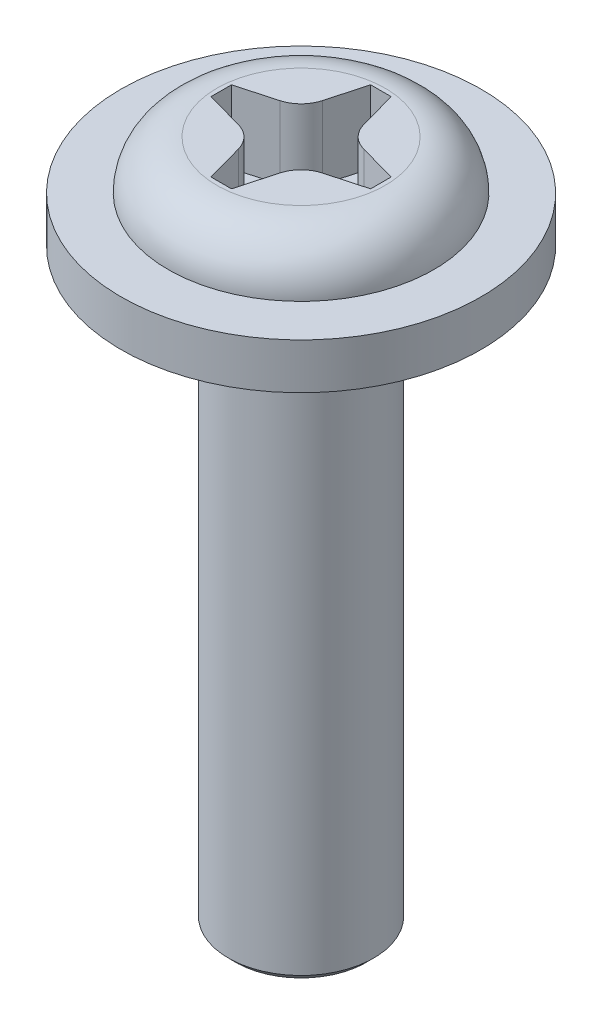
ISO-10303-21;
HEADER;
FILE_DESCRIPTION(('STEP AP214'),'2;1');
FILE_NAME('part.step','',(''),(''),'','','');
FILE_SCHEMA(('AUTOMOTIVE_DESIGN { 1 0 10303 214 1 1 1 1 }'));
ENDSEC;
DATA;
#1=APPLICATION_CONTEXT('core data for automotive mechanical design processes');
#2=APPLICATION_PROTOCOL_DEFINITION('international standard','automotive_design',2000,#1);
#3=PRODUCT_CONTEXT('',#1,'mechanical');
#4=PRODUCT('Part','Part','',(#3));
#5=PRODUCT_RELATED_PRODUCT_CATEGORY('part','',(#4));
#6=PRODUCT_DEFINITION_FORMATION('','',#4);
#7=PRODUCT_DEFINITION_CONTEXT('part definition',#1,'design');
#8=PRODUCT_DEFINITION('design','',#6,#7);
#9=PRODUCT_DEFINITION_SHAPE('','',#8);
#10=(LENGTH_UNIT() NAMED_UNIT(*) SI_UNIT(.MILLI.,.METRE.));
#11=(NAMED_UNIT(*) PLANE_ANGLE_UNIT() SI_UNIT($,.RADIAN.));
#12=(NAMED_UNIT(*) SI_UNIT($,.STERADIAN.) SOLID_ANGLE_UNIT());
#13=UNCERTAINTY_MEASURE_WITH_UNIT(LENGTH_MEASURE(1.E-05),#10,'distance_accuracy_value','');
#14=(GEOMETRIC_REPRESENTATION_CONTEXT(3) GLOBAL_UNCERTAINTY_ASSIGNED_CONTEXT((#13)) GLOBAL_UNIT_ASSIGNED_CONTEXT((#10,
#11,#12)) REPRESENTATION_CONTEXT('',''));
#15=CARTESIAN_POINT('',(0.,0.,0.));
#16=DIRECTION('',(0.,0.,1.));
#17=DIRECTION('',(1.,0.,0.));
#18=AXIS2_PLACEMENT_3D('',#15,#16,#17);
#19=CARTESIAN_POINT('',(0.,-9.4,0.));
#20=DIRECTION('',(0.,1.,0.));
#21=DIRECTION('',(-1.,0.,0.));
#22=AXIS2_PLACEMENT_3D('',#19,#20,#21);
#23=PLANE('',#22);
#24=CARTESIAN_POINT('',(0.,-9.4,0.));
#25=DIRECTION('',(0.,1.,0.));
#26=DIRECTION('',(-1.,0.,0.));
#27=AXIS2_PLACEMENT_3D('',#24,#25,#26);
#28=CIRCLE('',#27,0.9);
#29=CARTESIAN_POINT('',(-0.899999999999999,-9.4,0.));
#30=VERTEX_POINT('',#29);
#31=EDGE_CURVE('E11',#30,#30,#28,.T.);
#32=ORIENTED_EDGE('',*,*,#31,.F.);
#33=EDGE_LOOP('',(#32));
#34=FACE_BOUND('',#33,.T.);
#35=ADVANCED_FACE('F35',(#34),#23,.F.);
#36=CARTESIAN_POINT('',(0.,-9.4,0.));
#37=DIRECTION('',(0.,1.,0.));
#38=DIRECTION('',(-1.,0.,0.));
#39=AXIS2_PLACEMENT_3D('',#36,#37,#38);
#40=CONICAL_SURFACE('',#39,0.9,0.785398163397453);
#41=CARTESIAN_POINT('',(0.,-9.3,0.));
#42=DIRECTION('',(0.,1.,0.));
#43=DIRECTION('',(-1.,0.,0.));
#44=AXIS2_PLACEMENT_3D('',#41,#42,#43);
#45=CIRCLE('',#44,1.);
#46=CARTESIAN_POINT('',(-0.999999999999999,-9.3,0.));
#47=VERTEX_POINT('',#46);
#48=EDGE_CURVE('E42',#47,#47,#45,.T.);
#49=ORIENTED_EDGE('',*,*,#48,.F.);
#50=EDGE_LOOP('',(#49));
#51=FACE_BOUND('',#50,.T.);
#52=ORIENTED_EDGE('',*,*,#31,.T.);
#53=EDGE_LOOP('',(#52));
#54=FACE_BOUND('',#53,.T.);
#55=ADVANCED_FACE('F269',(#51,#54),#40,.T.);
#56=CARTESIAN_POINT('',(0.,0.,0.));
#57=DIRECTION('',(0.,1.,0.));
#58=DIRECTION('',(-1.,0.,0.));
#59=AXIS2_PLACEMENT_3D('',#56,#57,#58);
#60=CYLINDRICAL_SURFACE('',#59,1.);
#61=CARTESIAN_POINT('',(0.,-1.3,0.));
#62=DIRECTION('',(0.,1.,0.));
#63=DIRECTION('',(-1.,0.,0.));
#64=AXIS2_PLACEMENT_3D('',#61,#62,#63);
#65=CIRCLE('',#64,1.);
#66=CARTESIAN_POINT('',(-1.,-1.3,0.));
#67=VERTEX_POINT('',#66);
#68=EDGE_CURVE('E262',#67,#67,#65,.T.);
#69=ORIENTED_EDGE('',*,*,#68,.F.);
#70=EDGE_LOOP('',(#69));
#71=FACE_BOUND('',#70,.T.);
#72=ORIENTED_EDGE('',*,*,#48,.T.);
#73=EDGE_LOOP('',(#72));
#74=FACE_BOUND('',#73,.T.);
#75=ADVANCED_FACE('F267',(#71,#74),#60,.T.);
#76=CARTESIAN_POINT('',(1.,-1.3,0.));
#77=DIRECTION('',(0.,1.,0.));
#78=DIRECTION('',(-1.,0.,0.));
#79=AXIS2_PLACEMENT_3D('',#76,#77,#78);
#80=PLANE('',#79);
#81=CARTESIAN_POINT('',(0.,-1.3,0.));
#82=DIRECTION('',(0.,1.,0.));
#83=DIRECTION('',(-1.,0.,0.));
#84=AXIS2_PLACEMENT_3D('',#81,#82,#83);
#85=CIRCLE('',#84,2.48);
#86=CARTESIAN_POINT('',(-2.48,-1.3,0.));
#87=VERTEX_POINT('',#86);
#88=EDGE_CURVE('E259',#87,#87,#85,.T.);
#89=ORIENTED_EDGE('',*,*,#88,.F.);
#90=EDGE_LOOP('',(#89));
#91=FACE_BOUND('',#90,.T.);
#92=ORIENTED_EDGE('',*,*,#68,.T.);
#93=EDGE_LOOP('',(#92));
#94=FACE_BOUND('',#93,.T.);
#95=ADVANCED_FACE('F288',(#91,#94),#80,.F.);
#96=CARTESIAN_POINT('',(0.,0.,0.));
#97=DIRECTION('',(0.,1.,0.));
#98=DIRECTION('',(-1.,0.,0.));
#99=AXIS2_PLACEMENT_3D('',#96,#97,#98);
#100=CYLINDRICAL_SURFACE('',#99,2.48);
#101=CARTESIAN_POINT('',(0.,-0.67,0.));
#102=DIRECTION('',(0.,1.,0.));
#103=DIRECTION('',(-1.,0.,0.));
#104=AXIS2_PLACEMENT_3D('',#101,#102,#103);
#105=CIRCLE('',#104,2.48);
#106=CARTESIAN_POINT('',(-2.48,-0.670000000000001,0.));
#107=VERTEX_POINT('',#106);
#108=EDGE_CURVE('E256',#107,#107,#105,.T.);
#109=ORIENTED_EDGE('',*,*,#108,.F.);
#110=EDGE_LOOP('',(#109));
#111=FACE_BOUND('',#110,.T.);
#112=ORIENTED_EDGE('',*,*,#88,.T.);
#113=EDGE_LOOP('',(#112));
#114=FACE_BOUND('',#113,.T.);
#115=ADVANCED_FACE('F295',(#111,#114),#100,.T.);
#116=CARTESIAN_POINT('',(2.48,-0.67,0.));
#117=DIRECTION('',(0.,-1.,0.));
#118=DIRECTION('',(1.,0.,0.));
#119=AXIS2_PLACEMENT_3D('',#116,#117,#118);
#120=PLANE('',#119);
#121=CARTESIAN_POINT('',(0.,-0.67,0.));
#122=DIRECTION('',(0.,1.,0.));
#123=DIRECTION('',(-1.,0.,0.));
#124=AXIS2_PLACEMENT_3D('',#121,#122,#123);
#125=CIRCLE('',#124,1.83);
#126=CARTESIAN_POINT('',(-1.83,-0.67,0.));
#127=VERTEX_POINT('',#126);
#128=EDGE_CURVE('E253',#127,#127,#125,.T.);
#129=ORIENTED_EDGE('',*,*,#128,.F.);
#130=EDGE_LOOP('',(#129));
#131=FACE_BOUND('',#130,.T.);
#132=ORIENTED_EDGE('',*,*,#108,.T.);
#133=EDGE_LOOP('',(#132));
#134=FACE_BOUND('',#133,.T.);
#135=ADVANCED_FACE('F303',(#131,#134),#120,.F.);
#136=CARTESIAN_POINT('',(0.,-0.67,0.));
#137=DIRECTION('',(0.,1.,0.));
#138=DIRECTION('',(-1.,0.,0.));
#139=AXIS2_PLACEMENT_3D('',#136,#137,#138);
#140=TOROIDAL_SURFACE('',#139,1.16,0.67);
#141=CARTESIAN_POINT('',(0.,0.,0.));
#142=DIRECTION('',(0.,1.,0.));
#143=DIRECTION('',(-1.,0.,0.));
#144=AXIS2_PLACEMENT_3D('',#141,#142,#143);
#145=CIRCLE('',#144,1.16);
#146=CARTESIAN_POINT('',(-1.16,0.,0.));
#147=VERTEX_POINT('',#146);
#148=EDGE_CURVE('E225',#147,#147,#145,.T.);
#149=ORIENTED_EDGE('',*,*,#148,.F.);
#150=EDGE_LOOP('',(#149));
#151=FACE_BOUND('',#150,.T.);
#152=ORIENTED_EDGE('',*,*,#128,.T.);
#153=EDGE_LOOP('',(#152));
#154=FACE_BOUND('',#153,.T.);
#155=ADVANCED_FACE('F311',(#151,#154),#140,.T.);
#156=CARTESIAN_POINT('',(1.16,0.,0.));
#157=DIRECTION('',(0.,-1.,0.));
#158=DIRECTION('',(1.,0.,0.));
#159=AXIS2_PLACEMENT_3D('',#156,#157,#158);
#160=PLANE('',#159);
#161=DIRECTION('',(-0.266310401092353,0.,0.963887322393043));
#162=VECTOR('',#161,1.);
#163=CARTESIAN_POINT('',(-0.14140689687852,0.,-1.1));
#164=LINE('',#163,#162);
#165=CARTESIAN_POINT('',(-0.14140689687852,0.,-1.1));
#166=VERTEX_POINT('',#165);
#167=CARTESIAN_POINT('',(-0.285471458842035,0.,-0.578570854487268));
#168=VERTEX_POINT('',#167);
#169=EDGE_CURVE('E182',#166,#168,#164,.T.);
#170=ORIENTED_EDGE('',*,*,#169,.F.);
#171=DIRECTION('',(-1.,0.,0.));
#172=VECTOR('',#171,1.);
#173=CARTESIAN_POINT('',(0.,0.,-1.1));
#174=LINE('',#173,#172);
#175=CARTESIAN_POINT('',(0.141406896878543,0.,-1.1));
#176=VERTEX_POINT('',#175);
#177=EDGE_CURVE('E222',#176,#166,#174,.T.);
#178=ORIENTED_EDGE('',*,*,#177,.F.);
#179=DIRECTION('',(-0.266310401092333,0.,-0.963887322393049));
#180=VECTOR('',#179,1.);
#181=CARTESIAN_POINT('',(0.141406896878543,0.,-1.1));
#182=LINE('',#181,#180);
#183=CARTESIAN_POINT('',(0.285471458842047,0.,-0.578570854487262));
#184=VERTEX_POINT('',#183);
#185=EDGE_CURVE('E220',#184,#176,#182,.T.);
#186=ORIENTED_EDGE('',*,*,#185,.F.);
#187=CARTESIAN_POINT('',(0.690465923304419,0.,-0.690465923304412));
#188=DIRECTION('',(0.,-1.,0.));
#189=DIRECTION('',(-1.,0.,0.));
#190=AXIS2_PLACEMENT_3D('',#187,#188,#189);
#191=CIRCLE('',#190,0.420167850591592);
#192=CARTESIAN_POINT('',(0.578570854487265,0.,-0.285471458842041));
#193=VERTEX_POINT('',#192);
#194=EDGE_CURVE('E218',#193,#184,#191,.T.);
#195=ORIENTED_EDGE('',*,*,#194,.F.);
#196=DIRECTION('',(-0.963887322393046,0.,-0.266310401092343));
#197=VECTOR('',#196,1.);
#198=CARTESIAN_POINT('',(1.1,0.,-0.141406896878531));
#199=LINE('',#198,#197);
#200=CARTESIAN_POINT('',(1.1,0.,-0.141406896878531));
#201=VERTEX_POINT('',#200);
#202=EDGE_CURVE('E156',#201,#193,#199,.T.);
#203=ORIENTED_EDGE('',*,*,#202,.F.);
#204=DIRECTION('',(0.,0.,-1.));
#205=VECTOR('',#204,1.);
#206=CARTESIAN_POINT('',(1.1,0.,0.));
#207=LINE('',#206,#205);
#208=CARTESIAN_POINT('',(1.1,0.,0.141406896878547));
#209=VERTEX_POINT('',#208);
#210=EDGE_CURVE('E214',#209,#201,#207,.T.);
#211=ORIENTED_EDGE('',*,*,#210,.F.);
#212=DIRECTION('',(0.963887322393049,0.,-0.26631040109233));
#213=VECTOR('',#212,1.);
#214=CARTESIAN_POINT('',(1.1,0.,0.141406896878547));
#215=LINE('',#214,#213);
#216=CARTESIAN_POINT('',(0.578570854487261,0.,0.285471458842049));
#217=VERTEX_POINT('',#216);
#218=EDGE_CURVE('E211',#217,#209,#215,.T.);
#219=ORIENTED_EDGE('',*,*,#218,.F.);
#220=CARTESIAN_POINT('',(0.69046592330441,0.,0.690465923304422));
#221=DIRECTION('',(0.,-1.,0.));
#222=DIRECTION('',(-1.,0.,0.));
#223=AXIS2_PLACEMENT_3D('',#220,#221,#222);
#224=CIRCLE('',#223,0.420167850591592);
#225=CARTESIAN_POINT('',(0.285471458842039,0.,0.578570854487266));
#226=VERTEX_POINT('',#225);
#227=EDGE_CURVE('E208',#226,#217,#224,.T.);
#228=ORIENTED_EDGE('',*,*,#227,.F.);
#229=DIRECTION('',(0.266310401092347,0.,-0.963887322393045));
#230=VECTOR('',#229,1.);
#231=CARTESIAN_POINT('',(0.141406896878527,0.,1.1));
#232=LINE('',#231,#230);
#233=CARTESIAN_POINT('',(0.141406896878527,0.,1.1));
#234=VERTEX_POINT('',#233);
#235=EDGE_CURVE('E205',#234,#226,#232,.T.);
#236=ORIENTED_EDGE('',*,*,#235,.F.);
#237=DIRECTION('',(1.,0.,0.));
#238=VECTOR('',#237,1.);
#239=CARTESIAN_POINT('',(0.,0.,1.10000000000001));
#240=LINE('',#239,#238);
#241=CARTESIAN_POINT('',(-0.14140689687855,0.,1.1));
#242=VERTEX_POINT('',#241);
#243=EDGE_CURVE('E202',#242,#234,#240,.T.);
#244=ORIENTED_EDGE('',*,*,#243,.F.);
#245=DIRECTION('',(0.266310401092327,0.,0.96388732239305));
#246=VECTOR('',#245,1.);
#247=CARTESIAN_POINT('',(-0.14140689687855,0.,1.1));
#248=LINE('',#247,#246);
#249=CARTESIAN_POINT('',(-0.285471458842051,0.,0.57857085448726));
#250=VERTEX_POINT('',#249);
#251=EDGE_CURVE('E199',#250,#242,#248,.T.);
#252=ORIENTED_EDGE('',*,*,#251,.F.);
#253=CARTESIAN_POINT('',(-0.690465923304424,0.,0.690465923304407));
#254=DIRECTION('',(0.,-1.,0.));
#255=DIRECTION('',(-1.,0.,0.));
#256=AXIS2_PLACEMENT_3D('',#253,#254,#255);
#257=CIRCLE('',#256,0.420167850591592);
#258=CARTESIAN_POINT('',(-0.578570854487267,0.,0.285471458842037));
#259=VERTEX_POINT('',#258);
#260=EDGE_CURVE('E196',#259,#250,#257,.T.);
#261=ORIENTED_EDGE('',*,*,#260,.F.);
#262=DIRECTION('',(0.963887322393044,0.,0.26631040109235));
#263=VECTOR('',#262,1.);
#264=CARTESIAN_POINT('',(-1.1,0.,0.141406896878524));
#265=LINE('',#264,#263);
#266=CARTESIAN_POINT('',(-1.1,0.,0.141406896878524));
#267=VERTEX_POINT('',#266);
#268=EDGE_CURVE('E193',#267,#259,#265,.T.);
#269=ORIENTED_EDGE('',*,*,#268,.F.);
#270=DIRECTION('',(0.,0.,1.));
#271=VECTOR('',#270,1.);
#272=CARTESIAN_POINT('',(-1.1,0.,0.));
#273=LINE('',#272,#271);
#274=CARTESIAN_POINT('',(-1.1,0.,-0.141406896878554));
#275=VERTEX_POINT('',#274);
#276=EDGE_CURVE('E190',#275,#267,#273,.T.);
#277=ORIENTED_EDGE('',*,*,#276,.F.);
#278=DIRECTION('',(-0.963887322393051,0.,0.266310401092323));
#279=VECTOR('',#278,1.);
#280=CARTESIAN_POINT('',(-1.1,0.,-0.141406896878554));
#281=LINE('',#280,#279);
#282=CARTESIAN_POINT('',(-0.578570854487259,0.,-0.285471458842053));
#283=VERTEX_POINT('',#282);
#284=EDGE_CURVE('E187',#283,#275,#281,.T.);
#285=ORIENTED_EDGE('',*,*,#284,.F.);
#286=CARTESIAN_POINT('',(-0.690465923304405,0.,-0.690465923304427));
#287=DIRECTION('',(0.,-1.,0.));
#288=DIRECTION('',(-1.,0.,0.));
#289=AXIS2_PLACEMENT_3D('',#286,#287,#288);
#290=CIRCLE('',#289,0.420167850591592);
#291=EDGE_CURVE('E184',#168,#283,#290,.T.);
#292=ORIENTED_EDGE('',*,*,#291,.F.);
#293=EDGE_LOOP('',(#170,#178,#186,#195,#203,#211,#219,#228,#236,#244,#252,#261,#269,#277,#285,#292));
#294=FACE_BOUND('',#293,.T.);
#295=ORIENTED_EDGE('',*,*,#148,.T.);
#296=EDGE_LOOP('',(#295));
#297=FACE_BOUND('',#296,.T.);
#298=ADVANCED_FACE('F319',(#294,#297),#160,.F.);
#299=CARTESIAN_POINT('',(0.,-1.,-1.1));
#300=DIRECTION('',(0.,0.,-1.));
#301=DIRECTION('',(-1.,0.,0.));
#302=AXIS2_PLACEMENT_3D('',#299,#300,#301);
#303=PLANE('',#302);
#304=ORIENTED_EDGE('',*,*,#177,.T.);
#305=DIRECTION('',(0.,1.,0.));
#306=VECTOR('',#305,1.);
#307=CARTESIAN_POINT('',(-0.14140689687852,-1.,-1.1));
#308=LINE('',#307,#306);
#309=CARTESIAN_POINT('',(-0.14140689687852,-1.,-1.1));
#310=VERTEX_POINT('',#309);
#311=EDGE_CURVE('E49',#310,#166,#308,.T.);
#312=ORIENTED_EDGE('',*,*,#311,.F.);
#313=DIRECTION('',(-1.,0.,0.));
#314=VECTOR('',#313,1.);
#315=CARTESIAN_POINT('',(0.,-1.,-1.1));
#316=LINE('',#315,#314);
#317=CARTESIAN_POINT('',(0.141406896878543,-1.,-1.1));
#318=VERTEX_POINT('',#317);
#319=EDGE_CURVE('E57',#318,#310,#316,.T.);
#320=ORIENTED_EDGE('',*,*,#319,.F.);
#321=DIRECTION('',(0.,1.,0.));
#322=VECTOR('',#321,1.);
#323=CARTESIAN_POINT('',(0.141406896878543,-1.,-1.1));
#324=LINE('',#323,#322);
#325=EDGE_CURVE('E107',#318,#176,#324,.T.);
#326=ORIENTED_EDGE('',*,*,#325,.T.);
#327=EDGE_LOOP('',(#304,#312,#320,#326));
#328=FACE_BOUND('',#327,.T.);
#329=ADVANCED_FACE('F327',(#328),#303,.F.);
#330=CARTESIAN_POINT('',(0.141406896878543,-1.,-1.1));
#331=DIRECTION('',(0.963887322393049,0.,-0.266310401092333));
#332=DIRECTION('',(-0.266310401092333,0.,-0.963887322393049));
#333=AXIS2_PLACEMENT_3D('',#330,#331,#332);
#334=PLANE('',#333);
#335=ORIENTED_EDGE('',*,*,#185,.T.);
#336=ORIENTED_EDGE('',*,*,#325,.F.);
#337=DIRECTION('',(-0.266310401092333,0.,-0.963887322393049));
#338=VECTOR('',#337,1.);
#339=CARTESIAN_POINT('',(0.141406896878543,-1.,-1.1));
#340=LINE('',#339,#338);
#341=CARTESIAN_POINT('',(0.285471458842047,-1.,-0.578570854487262));
#342=VERTEX_POINT('',#341);
#343=EDGE_CURVE('E169',#342,#318,#340,.T.);
#344=ORIENTED_EDGE('',*,*,#343,.F.);
#345=DIRECTION('',(0.,1.,0.));
#346=VECTOR('',#345,1.);
#347=CARTESIAN_POINT('',(0.285471458842047,-1.,-0.578570854487262));
#348=LINE('',#347,#346);
#349=EDGE_CURVE('E160',#342,#184,#348,.T.);
#350=ORIENTED_EDGE('',*,*,#349,.T.);
#351=EDGE_LOOP('',(#335,#336,#344,#350));
#352=FACE_BOUND('',#351,.T.);
#353=ADVANCED_FACE('F335',(#352),#334,.F.);
#354=CARTESIAN_POINT('',(0.690465923304419,-1.,-0.690465923304412));
#355=DIRECTION('',(0.,1.,0.));
#356=DIRECTION('',(-1.,0.,0.));
#357=AXIS2_PLACEMENT_3D('',#354,#355,#356);
#358=CYLINDRICAL_SURFACE('',#357,0.420167850591592);
#359=ORIENTED_EDGE('',*,*,#194,.T.);
#360=ORIENTED_EDGE('',*,*,#349,.F.);
#361=CARTESIAN_POINT('',(0.690465923304419,-1.,-0.690465923304412));
#362=DIRECTION('',(0.,-1.,0.));
#363=DIRECTION('',(-1.,0.,0.));
#364=AXIS2_PLACEMENT_3D('',#361,#362,#363);
#365=CIRCLE('',#364,0.420167850591592);
#366=CARTESIAN_POINT('',(0.578570854487265,-1.,-0.285471458842041));
#367=VERTEX_POINT('',#366);
#368=EDGE_CURVE('E164',#367,#342,#365,.T.);
#369=ORIENTED_EDGE('',*,*,#368,.F.);
#370=DIRECTION('',(0.,1.,0.));
#371=VECTOR('',#370,1.);
#372=CARTESIAN_POINT('',(0.578570854487265,-1.,-0.285471458842041));
#373=LINE('',#372,#371);
#374=EDGE_CURVE('E150',#367,#193,#373,.T.);
#375=ORIENTED_EDGE('',*,*,#374,.T.);
#376=EDGE_LOOP('',(#359,#360,#369,#375));
#377=FACE_BOUND('',#376,.T.);
#378=ADVANCED_FACE('F165',(#377),#358,.T.);
#379=CARTESIAN_POINT('',(1.1,-1.,-0.141406896878531));
#380=DIRECTION('',(0.266310401092343,0.,-0.963887322393046));
#381=DIRECTION('',(-0.963887322393046,0.,-0.266310401092343));
#382=AXIS2_PLACEMENT_3D('',#379,#380,#381);
#383=PLANE('',#382);
#384=ORIENTED_EDGE('',*,*,#202,.T.);
#385=ORIENTED_EDGE('',*,*,#374,.F.);
#386=DIRECTION('',(-0.963887322393046,0.,-0.266310401092343));
#387=VECTOR('',#386,1.);
#388=CARTESIAN_POINT('',(1.1,-1.,-0.141406896878531));
#389=LINE('',#388,#387);
#390=CARTESIAN_POINT('',(1.1,-1.,-0.141406896878531));
#391=VERTEX_POINT('',#390);
#392=EDGE_CURVE('E154',#391,#367,#389,.T.);
#393=ORIENTED_EDGE('',*,*,#392,.F.);
#394=DIRECTION('',(0.,1.,0.));
#395=VECTOR('',#394,1.);
#396=CARTESIAN_POINT('',(1.1,-1.,-0.141406896878531));
#397=LINE('',#396,#395);
#398=EDGE_CURVE('E161',#391,#201,#397,.T.);
#399=ORIENTED_EDGE('',*,*,#398,.T.);
#400=EDGE_LOOP('',(#384,#385,#393,#399));
#401=FACE_BOUND('',#400,.T.);
#402=ADVANCED_FACE('F152',(#401),#383,.F.);
#403=CARTESIAN_POINT('',(1.1,-1.,0.));
#404=DIRECTION('',(1.,0.,0.));
#405=DIRECTION('',(0.,0.,-1.));
#406=AXIS2_PLACEMENT_3D('',#403,#404,#405);
#407=PLANE('',#406);
#408=ORIENTED_EDGE('',*,*,#210,.T.);
#409=ORIENTED_EDGE('',*,*,#398,.F.);
#410=DIRECTION('',(0.,0.,-1.));
#411=VECTOR('',#410,1.);
#412=CARTESIAN_POINT('',(1.1,-1.,0.));
#413=LINE('',#412,#411);
#414=CARTESIAN_POINT('',(1.1,-1.,0.141406896878547));
#415=VERTEX_POINT('',#414);
#416=EDGE_CURVE('E174',#415,#391,#413,.T.);
#417=ORIENTED_EDGE('',*,*,#416,.F.);
#418=DIRECTION('',(0.,1.,0.));
#419=VECTOR('',#418,1.);
#420=CARTESIAN_POINT('',(1.1,-1.,0.141406896878547));
#421=LINE('',#420,#419);
#422=EDGE_CURVE('E228',#415,#209,#421,.T.);
#423=ORIENTED_EDGE('',*,*,#422,.T.);
#424=EDGE_LOOP('',(#408,#409,#417,#423));
#425=FACE_BOUND('',#424,.T.);
#426=ADVANCED_FACE('F355',(#425),#407,.F.);
#427=CARTESIAN_POINT('',(1.1,-1.,0.141406896878547));
#428=DIRECTION('',(0.26631040109233,0.,0.963887322393049));
#429=DIRECTION('',(0.96388732239305,0.,-0.26631040109233));
#430=AXIS2_PLACEMENT_3D('',#427,#428,#429);
#431=PLANE('',#430);
#432=ORIENTED_EDGE('',*,*,#218,.T.);
#433=ORIENTED_EDGE('',*,*,#422,.F.);
#434=DIRECTION('',(0.963887322393049,0.,-0.26631040109233));
#435=VECTOR('',#434,1.);
#436=CARTESIAN_POINT('',(1.1,-1.,0.141406896878547));
#437=LINE('',#436,#435);
#438=CARTESIAN_POINT('',(0.578570854487261,-1.,0.285471458842049));
#439=VERTEX_POINT('',#438);
#440=EDGE_CURVE('E177',#439,#415,#437,.T.);
#441=ORIENTED_EDGE('',*,*,#440,.F.);
#442=DIRECTION('',(0.,1.,0.));
#443=VECTOR('',#442,1.);
#444=CARTESIAN_POINT('',(0.578570854487261,-1.,0.285471458842049));
#445=LINE('',#444,#443);
#446=EDGE_CURVE('E230',#439,#217,#445,.T.);
#447=ORIENTED_EDGE('',*,*,#446,.T.);
#448=EDGE_LOOP('',(#432,#433,#441,#447));
#449=FACE_BOUND('',#448,.T.);
#450=ADVANCED_FACE('F362',(#449),#431,.F.);
#451=CARTESIAN_POINT('',(0.69046592330441,-1.,0.690465923304422));
#452=DIRECTION('',(0.,1.,0.));
#453=DIRECTION('',(-1.,0.,0.));
#454=AXIS2_PLACEMENT_3D('',#451,#452,#453);
#455=CYLINDRICAL_SURFACE('',#454,0.420167850591592);
#456=ORIENTED_EDGE('',*,*,#227,.T.);
#457=ORIENTED_EDGE('',*,*,#446,.F.);
#458=CARTESIAN_POINT('',(0.69046592330441,-1.,0.690465923304422));
#459=DIRECTION('',(0.,-1.,0.));
#460=DIRECTION('',(-1.,0.,0.));
#461=AXIS2_PLACEMENT_3D('',#458,#459,#460);
#462=CIRCLE('',#461,0.420167850591592);
#463=CARTESIAN_POINT('',(0.285471458842039,-1.,0.578570854487266));
#464=VERTEX_POINT('',#463);
#465=EDGE_CURVE('E557',#464,#439,#462,.T.);
#466=ORIENTED_EDGE('',*,*,#465,.F.);
#467=DIRECTION('',(0.,1.,0.));
#468=VECTOR('',#467,1.);
#469=CARTESIAN_POINT('',(0.285471458842039,-1.,0.578570854487266));
#470=LINE('',#469,#468);
#471=EDGE_CURVE('E232',#464,#226,#470,.T.);
#472=ORIENTED_EDGE('',*,*,#471,.T.);
#473=EDGE_LOOP('',(#456,#457,#466,#472));
#474=FACE_BOUND('',#473,.T.);
#475=ADVANCED_FACE('F370',(#474),#455,.T.);
#476=CARTESIAN_POINT('',(0.141406896878527,-1.,1.1));
#477=DIRECTION('',(0.963887322393045,0.,0.266310401092347));
#478=DIRECTION('',(0.266310401092347,0.,-0.963887322393045));
#479=AXIS2_PLACEMENT_3D('',#476,#477,#478);
#480=PLANE('',#479);
#481=ORIENTED_EDGE('',*,*,#235,.T.);
#482=ORIENTED_EDGE('',*,*,#471,.F.);
#483=DIRECTION('',(0.266310401092347,0.,-0.963887322393045));
#484=VECTOR('',#483,1.);
#485=CARTESIAN_POINT('',(0.141406896878527,-1.,1.1));
#486=LINE('',#485,#484);
#487=CARTESIAN_POINT('',(0.141406896878527,-1.,1.1));
#488=VERTEX_POINT('',#487);
#489=EDGE_CURVE('E554',#488,#464,#486,.T.);
#490=ORIENTED_EDGE('',*,*,#489,.F.);
#491=DIRECTION('',(0.,1.,0.));
#492=VECTOR('',#491,1.);
#493=CARTESIAN_POINT('',(0.141406896878527,-1.,1.1));
#494=LINE('',#493,#492);
#495=EDGE_CURVE('E234',#488,#234,#494,.T.);
#496=ORIENTED_EDGE('',*,*,#495,.T.);
#497=EDGE_LOOP('',(#481,#482,#490,#496));
#498=FACE_BOUND('',#497,.T.);
#499=ADVANCED_FACE('F378',(#498),#480,.F.);
#500=CARTESIAN_POINT('',(0.,-1.,1.10000000000001));
#501=DIRECTION('',(0.,0.,1.));
#502=DIRECTION('',(1.,0.,0.));
#503=AXIS2_PLACEMENT_3D('',#500,#501,#502);
#504=PLANE('',#503);
#505=ORIENTED_EDGE('',*,*,#243,.T.);
#506=ORIENTED_EDGE('',*,*,#495,.F.);
#507=DIRECTION('',(1.,0.,0.));
#508=VECTOR('',#507,1.);
#509=CARTESIAN_POINT('',(0.,-1.,1.10000000000001));
#510=LINE('',#509,#508);
#511=CARTESIAN_POINT('',(-0.14140689687855,-1.,1.1));
#512=VERTEX_POINT('',#511);
#513=EDGE_CURVE('E552',#512,#488,#510,.T.);
#514=ORIENTED_EDGE('',*,*,#513,.F.);
#515=DIRECTION('',(0.,1.,0.));
#516=VECTOR('',#515,1.);
#517=CARTESIAN_POINT('',(-0.14140689687855,-1.,1.1));
#518=LINE('',#517,#516);
#519=EDGE_CURVE('E236',#512,#242,#518,.T.);
#520=ORIENTED_EDGE('',*,*,#519,.T.);
#521=EDGE_LOOP('',(#505,#506,#514,#520));
#522=FACE_BOUND('',#521,.T.);
#523=ADVANCED_FACE('F386',(#522),#504,.F.);
#524=CARTESIAN_POINT('',(-0.14140689687855,-1.,1.1));
#525=DIRECTION('',(-0.96388732239305,0.,0.266310401092327));
#526=DIRECTION('',(0.266310401092327,0.,0.96388732239305));
#527=AXIS2_PLACEMENT_3D('',#524,#525,#526);
#528=PLANE('',#527);
#529=ORIENTED_EDGE('',*,*,#251,.T.);
#530=ORIENTED_EDGE('',*,*,#519,.F.);
#531=DIRECTION('',(0.266310401092327,0.,0.96388732239305));
#532=VECTOR('',#531,1.);
#533=CARTESIAN_POINT('',(-0.14140689687855,-1.,1.1));
#534=LINE('',#533,#532);
#535=CARTESIAN_POINT('',(-0.285471458842051,-1.,0.57857085448726));
#536=VERTEX_POINT('',#535);
#537=EDGE_CURVE('E549',#536,#512,#534,.T.);
#538=ORIENTED_EDGE('',*,*,#537,.F.);
#539=DIRECTION('',(0.,1.,0.));
#540=VECTOR('',#539,1.);
#541=CARTESIAN_POINT('',(-0.285471458842051,-1.,0.57857085448726));
#542=LINE('',#541,#540);
#543=EDGE_CURVE('E238',#536,#250,#542,.T.);
#544=ORIENTED_EDGE('',*,*,#543,.T.);
#545=EDGE_LOOP('',(#529,#530,#538,#544));
#546=FACE_BOUND('',#545,.T.);
#547=ADVANCED_FACE('F394',(#546),#528,.F.);
#548=CARTESIAN_POINT('',(-0.690465923304424,-1.,0.690465923304407));
#549=DIRECTION('',(0.,1.,0.));
#550=DIRECTION('',(-1.,0.,0.));
#551=AXIS2_PLACEMENT_3D('',#548,#549,#550);
#552=CYLINDRICAL_SURFACE('',#551,0.420167850591592);
#553=ORIENTED_EDGE('',*,*,#260,.T.);
#554=ORIENTED_EDGE('',*,*,#543,.F.);
#555=CARTESIAN_POINT('',(-0.690465923304424,-1.,0.690465923304407));
#556=DIRECTION('',(0.,-1.,0.));
#557=DIRECTION('',(-1.,0.,0.));
#558=AXIS2_PLACEMENT_3D('',#555,#556,#557);
#559=CIRCLE('',#558,0.420167850591592);
#560=CARTESIAN_POINT('',(-0.578570854487267,-1.,0.285471458842037));
#561=VERTEX_POINT('',#560);
#562=EDGE_CURVE('E546',#561,#536,#559,.T.);
#563=ORIENTED_EDGE('',*,*,#562,.F.);
#564=DIRECTION('',(0.,1.,0.));
#565=VECTOR('',#564,1.);
#566=CARTESIAN_POINT('',(-0.578570854487267,-1.,0.285471458842037));
#567=LINE('',#566,#565);
#568=EDGE_CURVE('E240',#561,#259,#567,.T.);
#569=ORIENTED_EDGE('',*,*,#568,.T.);
#570=EDGE_LOOP('',(#553,#554,#563,#569));
#571=FACE_BOUND('',#570,.T.);
#572=ADVANCED_FACE('F402',(#571),#552,.T.);
#573=CARTESIAN_POINT('',(-1.1,-1.,0.141406896878524));
#574=DIRECTION('',(-0.26631040109235,0.,0.963887322393044));
#575=DIRECTION('',(0.963887322393044,0.,0.26631040109235));
#576=AXIS2_PLACEMENT_3D('',#573,#574,#575);
#577=PLANE('',#576);
#578=ORIENTED_EDGE('',*,*,#268,.T.);
#579=ORIENTED_EDGE('',*,*,#568,.F.);
#580=DIRECTION('',(0.963887322393044,0.,0.26631040109235));
#581=VECTOR('',#580,1.);
#582=CARTESIAN_POINT('',(-1.1,-1.,0.141406896878524));
#583=LINE('',#582,#581);
#584=CARTESIAN_POINT('',(-1.1,-1.,0.141406896878524));
#585=VERTEX_POINT('',#584);
#586=EDGE_CURVE('E543',#585,#561,#583,.T.);
#587=ORIENTED_EDGE('',*,*,#586,.F.);
#588=DIRECTION('',(0.,1.,0.));
#589=VECTOR('',#588,1.);
#590=CARTESIAN_POINT('',(-1.1,-1.,0.141406896878524));
#591=LINE('',#590,#589);
#592=EDGE_CURVE('E242',#585,#267,#591,.T.);
#593=ORIENTED_EDGE('',*,*,#592,.T.);
#594=EDGE_LOOP('',(#578,#579,#587,#593));
#595=FACE_BOUND('',#594,.T.);
#596=ADVANCED_FACE('F410',(#595),#577,.F.);
#597=CARTESIAN_POINT('',(-1.1,-1.,0.));
#598=DIRECTION('',(-1.,0.,0.));
#599=DIRECTION('',(0.,0.,1.));
#600=AXIS2_PLACEMENT_3D('',#597,#598,#599);
#601=PLANE('',#600);
#602=ORIENTED_EDGE('',*,*,#276,.T.);
#603=ORIENTED_EDGE('',*,*,#592,.F.);
#604=DIRECTION('',(0.,0.,1.));
#605=VECTOR('',#604,1.);
#606=CARTESIAN_POINT('',(-1.1,-1.,0.));
#607=LINE('',#606,#605);
#608=CARTESIAN_POINT('',(-1.1,-1.,-0.141406896878554));
#609=VERTEX_POINT('',#608);
#610=EDGE_CURVE('E541',#609,#585,#607,.T.);
#611=ORIENTED_EDGE('',*,*,#610,.F.);
#612=DIRECTION('',(0.,1.,0.));
#613=VECTOR('',#612,1.);
#614=CARTESIAN_POINT('',(-1.1,-1.,-0.141406896878554));
#615=LINE('',#614,#613);
#616=EDGE_CURVE('E244',#609,#275,#615,.T.);
#617=ORIENTED_EDGE('',*,*,#616,.T.);
#618=EDGE_LOOP('',(#602,#603,#611,#617));
#619=FACE_BOUND('',#618,.T.);
#620=ADVANCED_FACE('F418',(#619),#601,.F.);
#621=CARTESIAN_POINT('',(-1.1,-1.,-0.141406896878554));
#622=DIRECTION('',(-0.266310401092323,0.,-0.963887322393051));
#623=DIRECTION('',(-0.963887322393051,0.,0.266310401092323));
#624=AXIS2_PLACEMENT_3D('',#621,#622,#623);
#625=PLANE('',#624);
#626=ORIENTED_EDGE('',*,*,#284,.T.);
#627=ORIENTED_EDGE('',*,*,#616,.F.);
#628=DIRECTION('',(-0.963887322393051,0.,0.266310401092323));
#629=VECTOR('',#628,1.);
#630=CARTESIAN_POINT('',(-1.1,-1.,-0.141406896878554));
#631=LINE('',#630,#629);
#632=CARTESIAN_POINT('',(-0.578570854487259,-1.,-0.285471458842053));
#633=VERTEX_POINT('',#632);
#634=EDGE_CURVE('E534',#633,#609,#631,.T.);
#635=ORIENTED_EDGE('',*,*,#634,.F.);
#636=DIRECTION('',(0.,1.,0.));
#637=VECTOR('',#636,1.);
#638=CARTESIAN_POINT('',(-0.578570854487259,-1.,-0.285471458842053));
#639=LINE('',#638,#637);
#640=EDGE_CURVE('E246',#633,#283,#639,.T.);
#641=ORIENTED_EDGE('',*,*,#640,.T.);
#642=EDGE_LOOP('',(#626,#627,#635,#641));
#643=FACE_BOUND('',#642,.T.);
#644=ADVANCED_FACE('F426',(#643),#625,.F.);
#645=CARTESIAN_POINT('',(-0.690465923304405,-1.,-0.690465923304427));
#646=DIRECTION('',(0.,1.,0.));
#647=DIRECTION('',(-1.,0.,0.));
#648=AXIS2_PLACEMENT_3D('',#645,#646,#647);
#649=CYLINDRICAL_SURFACE('',#648,0.420167850591592);
#650=ORIENTED_EDGE('',*,*,#291,.T.);
#651=ORIENTED_EDGE('',*,*,#640,.F.);
#652=CARTESIAN_POINT('',(-0.690465923304405,-1.,-0.690465923304427));
#653=DIRECTION('',(0.,-1.,0.));
#654=DIRECTION('',(-1.,0.,0.));
#655=AXIS2_PLACEMENT_3D('',#652,#653,#654);
#656=CIRCLE('',#655,0.420167850591592);
#657=CARTESIAN_POINT('',(-0.285471458842035,-1.,-0.578570854487268));
#658=VERTEX_POINT('',#657);
#659=EDGE_CURVE('E531',#658,#633,#656,.T.);
#660=ORIENTED_EDGE('',*,*,#659,.F.);
#661=DIRECTION('',(0.,1.,0.));
#662=VECTOR('',#661,1.);
#663=CARTESIAN_POINT('',(-0.285471458842035,-1.,-0.578570854487268));
#664=LINE('',#663,#662);
#665=EDGE_CURVE('E248',#658,#168,#664,.T.);
#666=ORIENTED_EDGE('',*,*,#665,.T.);
#667=EDGE_LOOP('',(#650,#651,#660,#666));
#668=FACE_BOUND('',#667,.T.);
#669=ADVANCED_FACE('F434',(#668),#649,.T.);
#670=CARTESIAN_POINT('',(-0.14140689687852,-1.,-1.1));
#671=DIRECTION('',(-0.963887322393043,0.,-0.266310401092354));
#672=DIRECTION('',(-0.266310401092354,0.,0.963887322393043));
#673=AXIS2_PLACEMENT_3D('',#670,#671,#672);
#674=PLANE('',#673);
#675=ORIENTED_EDGE('',*,*,#169,.T.);
#676=ORIENTED_EDGE('',*,*,#665,.F.);
#677=DIRECTION('',(-0.266310401092353,0.,0.963887322393043));
#678=VECTOR('',#677,1.);
#679=CARTESIAN_POINT('',(-0.14140689687852,-1.,-1.1));
#680=LINE('',#679,#678);
#681=EDGE_CURVE('E535',#310,#658,#680,.T.);
#682=ORIENTED_EDGE('',*,*,#681,.F.);
#683=ORIENTED_EDGE('',*,*,#311,.T.);
#684=EDGE_LOOP('',(#675,#676,#682,#683));
#685=FACE_BOUND('',#684,.T.);
#686=ADVANCED_FACE('F442',(#685),#674,.F.);
#687=CARTESIAN_POINT('',(-0.690465923304405,-1.,-0.690465923304427));
#688=DIRECTION('',(0.,1.,0.));
#689=DIRECTION('',(-1.,0.,0.));
#690=AXIS2_PLACEMENT_3D('',#687,#688,#689);
#691=PLANE('',#690);
#692=ORIENTED_EDGE('',*,*,#319,.T.);
#693=ORIENTED_EDGE('',*,*,#681,.T.);
#694=ORIENTED_EDGE('',*,*,#659,.T.);
#695=ORIENTED_EDGE('',*,*,#634,.T.);
#696=ORIENTED_EDGE('',*,*,#610,.T.);
#697=ORIENTED_EDGE('',*,*,#586,.T.);
#698=ORIENTED_EDGE('',*,*,#562,.T.);
#699=ORIENTED_EDGE('',*,*,#537,.T.);
#700=ORIENTED_EDGE('',*,*,#513,.T.);
#701=ORIENTED_EDGE('',*,*,#489,.T.);
#702=ORIENTED_EDGE('',*,*,#465,.T.);
#703=ORIENTED_EDGE('',*,*,#440,.T.);
#704=ORIENTED_EDGE('',*,*,#416,.T.);
#705=ORIENTED_EDGE('',*,*,#392,.T.);
#706=ORIENTED_EDGE('',*,*,#368,.T.);
#707=ORIENTED_EDGE('',*,*,#343,.T.);
#708=EDGE_LOOP('',(#692,#693,#694,#695,#696,#697,#698,#699,#700,#701,#702,#703,#704,#705,#706,#707));
#709=FACE_BOUND('',#708,.T.);
#710=ADVANCED_FACE('F171',(#709),#691,.T.);
#711=CLOSED_SHELL('',(#35,#55,#75,#95,#115,#135,#155,#298,#329,#353,#378,#402,#426,#450,#475,
#499,#523,#547,#572,#596,#620,#644,#669,#686,#710));
#712=MANIFOLD_SOLID_BREP('B2',#711);
#713=ADVANCED_BREP_SHAPE_REPRESENTATION('',(#18,#712),#14);
#714=SHAPE_DEFINITION_REPRESENTATION(#9,#713);
ENDSEC;
END-ISO-10303-21;
